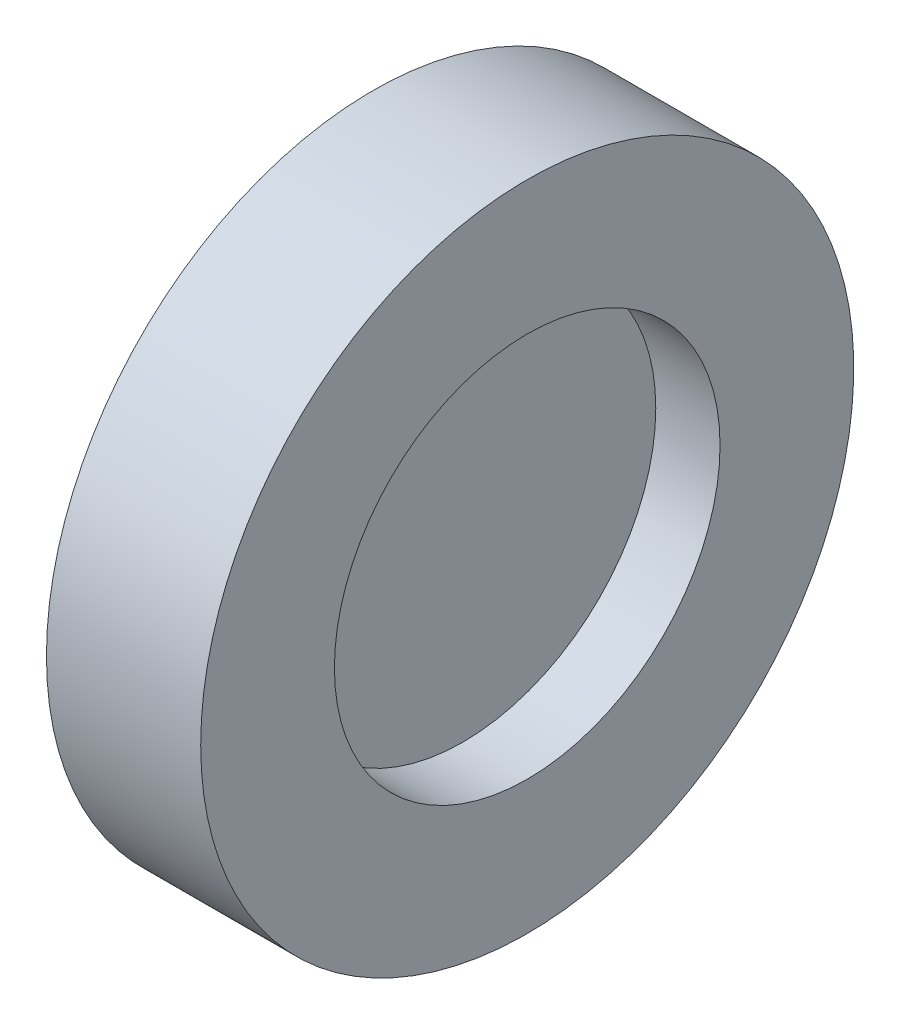
ISO-10303-21;
HEADER;
FILE_DESCRIPTION(('STEP AP214'),'2;1');
FILE_NAME('part.step','',(''),(''),'','','');
FILE_SCHEMA(('AUTOMOTIVE_DESIGN { 1 0 10303 214 1 1 1 1 }'));
ENDSEC;
DATA;
#1=APPLICATION_CONTEXT('core data for automotive mechanical design processes');
#2=APPLICATION_PROTOCOL_DEFINITION('international standard','automotive_design',2000,#1);
#3=PRODUCT_CONTEXT('',#1,'mechanical');
#4=PRODUCT('Part','Part','',(#3));
#5=PRODUCT_RELATED_PRODUCT_CATEGORY('part','',(#4));
#6=PRODUCT_DEFINITION_FORMATION('','',#4);
#7=PRODUCT_DEFINITION_CONTEXT('part definition',#1,'design');
#8=PRODUCT_DEFINITION('design','',#6,#7);
#9=PRODUCT_DEFINITION_SHAPE('','',#8);
#10=(LENGTH_UNIT() NAMED_UNIT(*) SI_UNIT(.MILLI.,.METRE.));
#11=(NAMED_UNIT(*) PLANE_ANGLE_UNIT() SI_UNIT($,.RADIAN.));
#12=(NAMED_UNIT(*) SI_UNIT($,.STERADIAN.) SOLID_ANGLE_UNIT());
#13=UNCERTAINTY_MEASURE_WITH_UNIT(LENGTH_MEASURE(1.E-05),#10,'distance_accuracy_value','');
#14=(GEOMETRIC_REPRESENTATION_CONTEXT(3) GLOBAL_UNCERTAINTY_ASSIGNED_CONTEXT((#13)) GLOBAL_UNIT_ASSIGNED_CONTEXT((#10,
#11,#12)) REPRESENTATION_CONTEXT('',''));
#15=CARTESIAN_POINT('',(0.,0.,0.));
#16=DIRECTION('',(0.,0.,1.));
#17=DIRECTION('',(1.,0.,0.));
#18=AXIS2_PLACEMENT_3D('',#15,#16,#17);
#19=CARTESIAN_POINT('',(0.5,7.5,0.));
#20=DIRECTION('',(-1.,0.,0.));
#21=DIRECTION('',(0.,0.,1.));
#22=AXIS2_PLACEMENT_3D('',#19,#20,#21);
#23=PLANE('',#22);
#24=CARTESIAN_POINT('',(0.500000000000001,0.,0.));
#25=DIRECTION('',(-1.,0.,0.));
#26=DIRECTION('',(0.,0.,1.));
#27=AXIS2_PLACEMENT_3D('',#24,#25,#26);
#28=CIRCLE('',#27,7.5);
#29=CARTESIAN_POINT('',(0.500000000000001,0.,7.5));
#30=VERTEX_POINT('',#29);
#31=EDGE_CURVE('E10',#30,#30,#28,.T.);
#32=ORIENTED_EDGE('',*,*,#31,.F.);
#33=EDGE_LOOP('',(#32));
#34=FACE_BOUND('',#33,.T.);
#35=ADVANCED_FACE('F37',(#34),#23,.F.);
#36=CARTESIAN_POINT('',(-1.61421241885762,0.,0.));
#37=DIRECTION('',(-1.,0.,0.));
#38=DIRECTION('',(0.,0.,1.));
#39=AXIS2_PLACEMENT_3D('',#36,#37,#38);
#40=CYLINDRICAL_SURFACE('',#39,7.5);
#41=CARTESIAN_POINT('',(3.,0.,0.));
#42=DIRECTION('',(-1.,0.,0.));
#43=DIRECTION('',(0.,0.,1.));
#44=AXIS2_PLACEMENT_3D('',#41,#42,#43);
#45=CIRCLE('',#44,7.5);
#46=CARTESIAN_POINT('',(3.,0.,7.5));
#47=VERTEX_POINT('',#46);
#48=EDGE_CURVE('E60',#47,#47,#45,.T.);
#49=ORIENTED_EDGE('',*,*,#48,.F.);
#50=EDGE_LOOP('',(#49));
#51=FACE_BOUND('',#50,.T.);
#52=ORIENTED_EDGE('',*,*,#31,.T.);
#53=EDGE_LOOP('',(#52));
#54=FACE_BOUND('',#53,.T.);
#55=ADVANCED_FACE('F90',(#51,#54),#40,.F.);
#56=CARTESIAN_POINT('',(-3.,0.,0.));
#57=DIRECTION('',(-1.,0.,0.));
#58=DIRECTION('',(0.,0.,1.));
#59=AXIS2_PLACEMENT_3D('',#56,#57,#58);
#60=CIRCLE('',#59,7.5);
#61=CARTESIAN_POINT('',(-3.,0.,7.5));
#62=VERTEX_POINT('',#61);
#63=EDGE_CURVE('E64',#62,#62,#60,.T.);
#64=ORIENTED_EDGE('',*,*,#63,.T.);
#65=EDGE_LOOP('',(#64));
#66=FACE_BOUND('',#65,.T.);
#67=CARTESIAN_POINT('',(-0.5,0.,0.));
#68=DIRECTION('',(1.,0.,0.));
#69=DIRECTION('',(0.,0.,-1.));
#70=AXIS2_PLACEMENT_3D('',#67,#68,#69);
#71=CIRCLE('',#70,7.5);
#72=CARTESIAN_POINT('',(-0.5,0.,-7.5));
#73=VERTEX_POINT('',#72);
#74=EDGE_CURVE('E44',#73,#73,#71,.T.);
#75=ORIENTED_EDGE('',*,*,#74,.T.);
#76=EDGE_LOOP('',(#75));
#77=FACE_BOUND('',#76,.T.);
#78=ADVANCED_FACE('F69',(#66,#77),#40,.F.);
#79=CARTESIAN_POINT('',(-3.,7.5,0.));
#80=DIRECTION('',(1.,0.,0.));
#81=DIRECTION('',(0.,0.,-1.));
#82=AXIS2_PLACEMENT_3D('',#79,#80,#81);
#83=PLANE('',#82);
#84=ORIENTED_EDGE('',*,*,#63,.F.);
#85=EDGE_LOOP('',(#84));
#86=FACE_BOUND('',#85,.T.);
#87=CARTESIAN_POINT('',(-3.,0.,0.));
#88=DIRECTION('',(-1.,0.,0.));
#89=DIRECTION('',(0.,0.,1.));
#90=AXIS2_PLACEMENT_3D('',#87,#88,#89);
#91=CIRCLE('',#90,12.7);
#92=CARTESIAN_POINT('',(-3.,0.,12.7));
#93=VERTEX_POINT('',#92);
#94=EDGE_CURVE('E49',#93,#93,#91,.T.);
#95=ORIENTED_EDGE('',*,*,#94,.T.);
#96=EDGE_LOOP('',(#95));
#97=FACE_BOUND('',#96,.T.);
#98=ADVANCED_FACE('F71',(#86,#97),#83,.F.);
#99=CARTESIAN_POINT('',(-1.61421241885762,0.,0.));
#100=DIRECTION('',(-1.,0.,0.));
#101=DIRECTION('',(0.,0.,1.));
#102=AXIS2_PLACEMENT_3D('',#99,#100,#101);
#103=CYLINDRICAL_SURFACE('',#102,12.7);
#104=ORIENTED_EDGE('',*,*,#94,.F.);
#105=EDGE_LOOP('',(#104));
#106=FACE_BOUND('',#105,.T.);
#107=CARTESIAN_POINT('',(3.,0.,0.));
#108=DIRECTION('',(-1.,0.,0.));
#109=DIRECTION('',(0.,0.,1.));
#110=AXIS2_PLACEMENT_3D('',#107,#108,#109);
#111=CIRCLE('',#110,12.7);
#112=CARTESIAN_POINT('',(3.,0.,12.7));
#113=VERTEX_POINT('',#112);
#114=EDGE_CURVE('E54',#113,#113,#111,.T.);
#115=ORIENTED_EDGE('',*,*,#114,.T.);
#116=EDGE_LOOP('',(#115));
#117=FACE_BOUND('',#116,.T.);
#118=ADVANCED_FACE('F74',(#106,#117),#103,.T.);
#119=CARTESIAN_POINT('',(3.,12.7,0.));
#120=DIRECTION('',(-1.,0.,0.));
#121=DIRECTION('',(0.,0.,1.));
#122=AXIS2_PLACEMENT_3D('',#119,#120,#121);
#123=PLANE('',#122);
#124=ORIENTED_EDGE('',*,*,#114,.F.);
#125=EDGE_LOOP('',(#124));
#126=FACE_BOUND('',#125,.T.);
#127=ORIENTED_EDGE('',*,*,#48,.T.);
#128=EDGE_LOOP('',(#127));
#129=FACE_BOUND('',#128,.T.);
#130=ADVANCED_FACE('F80',(#126,#129),#123,.F.);
#131=CARTESIAN_POINT('',(-0.5,7.5,0.));
#132=DIRECTION('',(1.,0.,0.));
#133=DIRECTION('',(0.,0.,-1.));
#134=AXIS2_PLACEMENT_3D('',#131,#132,#133);
#135=PLANE('',#134);
#136=ORIENTED_EDGE('',*,*,#74,.F.);
#137=EDGE_LOOP('',(#136));
#138=FACE_BOUND('',#137,.T.);
#139=ADVANCED_FACE('F86',(#138),#135,.F.);
#140=CLOSED_SHELL('',(#35,#55,#78,#98,#118,#130,#139));
#141=MANIFOLD_SOLID_BREP('B2',#140);
#142=ADVANCED_BREP_SHAPE_REPRESENTATION('',(#18,#141),#14);
#143=SHAPE_DEFINITION_REPRESENTATION(#9,#142);
ENDSEC;
END-ISO-10303-21;
